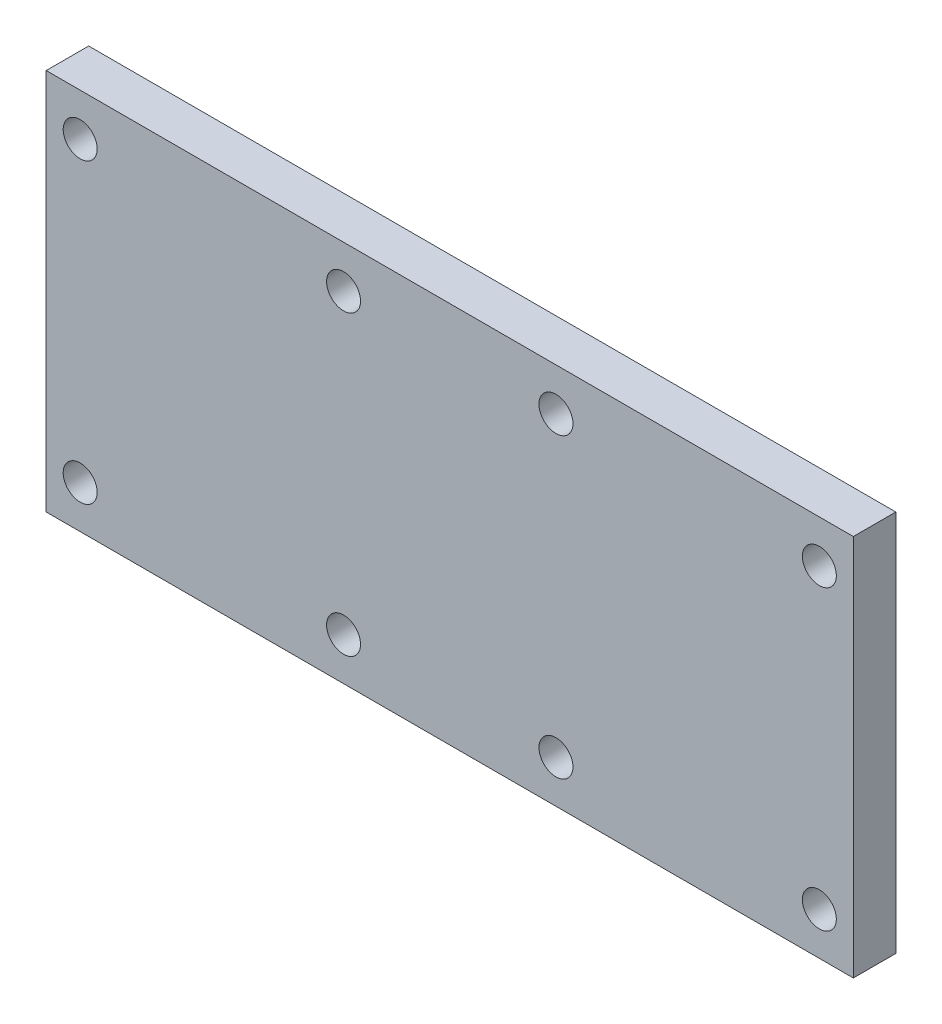
ISO-10303-21;
HEADER;
FILE_DESCRIPTION(('STEP AP214'),'2;1');
FILE_NAME('part.step','',(''),(''),'','','');
FILE_SCHEMA(('AUTOMOTIVE_DESIGN { 1 0 10303 214 1 1 1 1 }'));
ENDSEC;
DATA;
#1=APPLICATION_CONTEXT('core data for automotive mechanical design processes');
#2=APPLICATION_PROTOCOL_DEFINITION('international standard','automotive_design',2000,#1);
#3=PRODUCT_CONTEXT('',#1,'mechanical');
#4=PRODUCT('Part','Part','',(#3));
#5=PRODUCT_RELATED_PRODUCT_CATEGORY('part','',(#4));
#6=PRODUCT_DEFINITION_FORMATION('','',#4);
#7=PRODUCT_DEFINITION_CONTEXT('part definition',#1,'design');
#8=PRODUCT_DEFINITION('design','',#6,#7);
#9=PRODUCT_DEFINITION_SHAPE('','',#8);
#10=(LENGTH_UNIT() NAMED_UNIT(*) SI_UNIT(.MILLI.,.METRE.));
#11=(NAMED_UNIT(*) PLANE_ANGLE_UNIT() SI_UNIT($,.RADIAN.));
#12=(NAMED_UNIT(*) SI_UNIT($,.STERADIAN.) SOLID_ANGLE_UNIT());
#13=UNCERTAINTY_MEASURE_WITH_UNIT(LENGTH_MEASURE(1.E-05),#10,'distance_accuracy_value','');
#14=(GEOMETRIC_REPRESENTATION_CONTEXT(3) GLOBAL_UNCERTAINTY_ASSIGNED_CONTEXT((#13)) GLOBAL_UNIT_ASSIGNED_CONTEXT((#10,
#11,#12)) REPRESENTATION_CONTEXT('',''));
#15=CARTESIAN_POINT('',(0.,0.,0.));
#16=DIRECTION('',(0.,0.,1.));
#17=DIRECTION('',(1.,0.,0.));
#18=AXIS2_PLACEMENT_3D('',#15,#16,#17);
#19=CARTESIAN_POINT('',(47.5,22.5,5.));
#20=DIRECTION('',(-1.,0.,0.));
#21=DIRECTION('',(0.,-1.,0.));
#22=AXIS2_PLACEMENT_3D('',#19,#20,#21);
#23=PLANE('',#22);
#24=DIRECTION('',(0.,1.,0.));
#25=VECTOR('',#24,1.);
#26=CARTESIAN_POINT('',(47.5,22.5,0.));
#27=LINE('',#26,#25);
#28=CARTESIAN_POINT('',(47.5,-22.5,0.));
#29=VERTEX_POINT('',#28);
#30=CARTESIAN_POINT('',(47.5,22.5,0.));
#31=VERTEX_POINT('',#30);
#32=EDGE_CURVE('E96',#29,#31,#27,.T.);
#33=ORIENTED_EDGE('',*,*,#32,.T.);
#34=DIRECTION('',(0.,0.,-1.));
#35=VECTOR('',#34,1.);
#36=CARTESIAN_POINT('',(47.5,22.5,5.));
#37=LINE('',#36,#35);
#38=CARTESIAN_POINT('',(47.5,22.5,5.));
#39=VERTEX_POINT('',#38);
#40=EDGE_CURVE('E11',#39,#31,#37,.T.);
#41=ORIENTED_EDGE('',*,*,#40,.F.);
#42=DIRECTION('',(0.,1.,0.));
#43=VECTOR('',#42,1.);
#44=CARTESIAN_POINT('',(47.5,22.5,5.));
#45=LINE('',#44,#43);
#46=CARTESIAN_POINT('',(47.5,-22.5,5.));
#47=VERTEX_POINT('',#46);
#48=EDGE_CURVE('E84',#47,#39,#45,.T.);
#49=ORIENTED_EDGE('',*,*,#48,.F.);
#50=DIRECTION('',(0.,0.,-1.));
#51=VECTOR('',#50,1.);
#52=CARTESIAN_POINT('',(47.5,-22.5,5.));
#53=LINE('',#52,#51);
#54=EDGE_CURVE('E92',#47,#29,#53,.T.);
#55=ORIENTED_EDGE('',*,*,#54,.T.);
#56=EDGE_LOOP('',(#33,#41,#49,#55));
#57=FACE_BOUND('',#56,.T.);
#58=ADVANCED_FACE('F33',(#57),#23,.F.);
#59=CARTESIAN_POINT('',(-47.5,22.5,5.));
#60=DIRECTION('',(0.,-1.,0.));
#61=DIRECTION('',(0.,0.,-1.));
#62=AXIS2_PLACEMENT_3D('',#59,#60,#61);
#63=PLANE('',#62);
#64=DIRECTION('',(-1.,0.,0.));
#65=VECTOR('',#64,1.);
#66=CARTESIAN_POINT('',(-47.5,22.5,0.));
#67=LINE('',#66,#65);
#68=CARTESIAN_POINT('',(-47.5,22.5,0.));
#69=VERTEX_POINT('',#68);
#70=EDGE_CURVE('E88',#31,#69,#67,.T.);
#71=ORIENTED_EDGE('',*,*,#70,.T.);
#72=DIRECTION('',(0.,0.,-1.));
#73=VECTOR('',#72,1.);
#74=CARTESIAN_POINT('',(-47.5,22.5,5.));
#75=LINE('',#74,#73);
#76=CARTESIAN_POINT('',(-47.5,22.5,5.));
#77=VERTEX_POINT('',#76);
#78=EDGE_CURVE('E41',#77,#69,#75,.T.);
#79=ORIENTED_EDGE('',*,*,#78,.F.);
#80=DIRECTION('',(-1.,0.,0.));
#81=VECTOR('',#80,1.);
#82=CARTESIAN_POINT('',(-47.5,22.5,5.));
#83=LINE('',#82,#81);
#84=EDGE_CURVE('E79',#39,#77,#83,.T.);
#85=ORIENTED_EDGE('',*,*,#84,.F.);
#86=ORIENTED_EDGE('',*,*,#40,.T.);
#87=EDGE_LOOP('',(#71,#79,#85,#86));
#88=FACE_BOUND('',#87,.T.);
#89=ADVANCED_FACE('F87',(#88),#63,.F.);
#90=CARTESIAN_POINT('',(-47.5,22.5,5.));
#91=DIRECTION('',(1.,0.,0.));
#92=DIRECTION('',(0.,1.,0.));
#93=AXIS2_PLACEMENT_3D('',#90,#91,#92);
#94=PLANE('',#93);
#95=DIRECTION('',(0.,-1.,0.));
#96=VECTOR('',#95,1.);
#97=CARTESIAN_POINT('',(-47.5,22.5,0.));
#98=LINE('',#97,#96);
#99=CARTESIAN_POINT('',(-47.5,-22.5,0.));
#100=VERTEX_POINT('',#99);
#101=EDGE_CURVE('E66',#69,#100,#98,.T.);
#102=ORIENTED_EDGE('',*,*,#101,.T.);
#103=DIRECTION('',(0.,0.,-1.));
#104=VECTOR('',#103,1.);
#105=CARTESIAN_POINT('',(-47.5,-22.5,5.));
#106=LINE('',#105,#104);
#107=CARTESIAN_POINT('',(-47.5,-22.5,5.));
#108=VERTEX_POINT('',#107);
#109=EDGE_CURVE('E89',#108,#100,#106,.T.);
#110=ORIENTED_EDGE('',*,*,#109,.F.);
#111=DIRECTION('',(0.,-1.,0.));
#112=VECTOR('',#111,1.);
#113=CARTESIAN_POINT('',(-47.5,22.5,5.));
#114=LINE('',#113,#112);
#115=EDGE_CURVE('E82',#77,#108,#114,.T.);
#116=ORIENTED_EDGE('',*,*,#115,.F.);
#117=ORIENTED_EDGE('',*,*,#78,.T.);
#118=EDGE_LOOP('',(#102,#110,#116,#117));
#119=FACE_BOUND('',#118,.T.);
#120=ADVANCED_FACE('F90',(#119),#94,.F.);
#121=CARTESIAN_POINT('',(-47.5,-22.5,5.));
#122=DIRECTION('',(0.,1.,0.));
#123=DIRECTION('',(0.,0.,1.));
#124=AXIS2_PLACEMENT_3D('',#121,#122,#123);
#125=PLANE('',#124);
#126=DIRECTION('',(1.,0.,0.));
#127=VECTOR('',#126,1.);
#128=CARTESIAN_POINT('',(-47.5,-22.5,0.));
#129=LINE('',#128,#127);
#130=EDGE_CURVE('E72',#100,#29,#129,.T.);
#131=ORIENTED_EDGE('',*,*,#130,.T.);
#132=ORIENTED_EDGE('',*,*,#54,.F.);
#133=DIRECTION('',(1.,0.,0.));
#134=VECTOR('',#133,1.);
#135=CARTESIAN_POINT('',(-47.5,-22.5,5.));
#136=LINE('',#135,#134);
#137=EDGE_CURVE('E49',#108,#47,#136,.T.);
#138=ORIENTED_EDGE('',*,*,#137,.F.);
#139=ORIENTED_EDGE('',*,*,#109,.T.);
#140=EDGE_LOOP('',(#131,#132,#138,#139));
#141=FACE_BOUND('',#140,.T.);
#142=ADVANCED_FACE('F104',(#141),#125,.F.);
#143=CARTESIAN_POINT('',(0.,0.,5.));
#144=DIRECTION('',(0.,0.,1.));
#145=DIRECTION('',(1.,0.,0.));
#146=AXIS2_PLACEMENT_3D('',#143,#144,#145);
#147=PLANE('',#146);
#148=CARTESIAN_POINT('',(43.5,-17.5,5.));
#149=DIRECTION('',(0.,0.,1.));
#150=DIRECTION('',(1.,0.,0.));
#151=AXIS2_PLACEMENT_3D('',#148,#149,#150);
#152=CIRCLE('',#151,2.00000000000001);
#153=CARTESIAN_POINT('',(45.5,-17.5,5.));
#154=VERTEX_POINT('',#153);
#155=EDGE_CURVE('E135',#154,#154,#152,.T.);
#156=ORIENTED_EDGE('',*,*,#155,.F.);
#157=EDGE_LOOP('',(#156));
#158=FACE_BOUND('',#157,.T.);
#159=CARTESIAN_POINT('',(12.5,-17.5,5.));
#160=DIRECTION('',(0.,0.,1.));
#161=DIRECTION('',(1.,0.,0.));
#162=AXIS2_PLACEMENT_3D('',#159,#160,#161);
#163=CIRCLE('',#162,2.);
#164=CARTESIAN_POINT('',(14.5,-17.5,5.));
#165=VERTEX_POINT('',#164);
#166=EDGE_CURVE('E129',#165,#165,#163,.T.);
#167=ORIENTED_EDGE('',*,*,#166,.F.);
#168=EDGE_LOOP('',(#167));
#169=FACE_BOUND('',#168,.T.);
#170=CARTESIAN_POINT('',(12.5,17.5,5.));
#171=DIRECTION('',(0.,0.,1.));
#172=DIRECTION('',(1.,0.,0.));
#173=AXIS2_PLACEMENT_3D('',#170,#171,#172);
#174=CIRCLE('',#173,2.00000000000001);
#175=CARTESIAN_POINT('',(14.5,17.5,5.));
#176=VERTEX_POINT('',#175);
#177=EDGE_CURVE('E123',#176,#176,#174,.T.);
#178=ORIENTED_EDGE('',*,*,#177,.F.);
#179=EDGE_LOOP('',(#178));
#180=FACE_BOUND('',#179,.T.);
#181=CARTESIAN_POINT('',(-12.5,17.5,5.));
#182=DIRECTION('',(0.,0.,1.));
#183=DIRECTION('',(1.,0.,0.));
#184=AXIS2_PLACEMENT_3D('',#181,#182,#183);
#185=CIRCLE('',#184,2.);
#186=CARTESIAN_POINT('',(-10.5,17.5,5.));
#187=VERTEX_POINT('',#186);
#188=EDGE_CURVE('E116',#187,#187,#185,.T.);
#189=ORIENTED_EDGE('',*,*,#188,.F.);
#190=EDGE_LOOP('',(#189));
#191=FACE_BOUND('',#190,.T.);
#192=CARTESIAN_POINT('',(-12.5,-17.5,5.));
#193=DIRECTION('',(0.,0.,1.));
#194=DIRECTION('',(1.,0.,0.));
#195=AXIS2_PLACEMENT_3D('',#192,#193,#194);
#196=CIRCLE('',#195,2.);
#197=CARTESIAN_POINT('',(-10.5,-17.5,5.));
#198=VERTEX_POINT('',#197);
#199=EDGE_CURVE('E152',#198,#198,#196,.T.);
#200=ORIENTED_EDGE('',*,*,#199,.F.);
#201=EDGE_LOOP('',(#200));
#202=FACE_BOUND('',#201,.T.);
#203=CARTESIAN_POINT('',(-43.5,-17.5,5.));
#204=DIRECTION('',(0.,0.,1.));
#205=DIRECTION('',(1.,0.,0.));
#206=AXIS2_PLACEMENT_3D('',#203,#204,#205);
#207=CIRCLE('',#206,2.);
#208=CARTESIAN_POINT('',(-41.5,-17.5,5.));
#209=VERTEX_POINT('',#208);
#210=EDGE_CURVE('E146',#209,#209,#207,.T.);
#211=ORIENTED_EDGE('',*,*,#210,.F.);
#212=EDGE_LOOP('',(#211));
#213=FACE_BOUND('',#212,.T.);
#214=CARTESIAN_POINT('',(-43.5,17.5,5.));
#215=DIRECTION('',(0.,0.,1.));
#216=DIRECTION('',(1.,0.,0.));
#217=AXIS2_PLACEMENT_3D('',#214,#215,#216);
#218=CIRCLE('',#217,2.);
#219=CARTESIAN_POINT('',(-41.5,17.5,5.));
#220=VERTEX_POINT('',#219);
#221=EDGE_CURVE('E140',#220,#220,#218,.T.);
#222=ORIENTED_EDGE('',*,*,#221,.F.);
#223=EDGE_LOOP('',(#222));
#224=FACE_BOUND('',#223,.T.);
#225=CARTESIAN_POINT('',(43.5,17.5,5.));
#226=DIRECTION('',(0.,0.,1.));
#227=DIRECTION('',(1.,0.,0.));
#228=AXIS2_PLACEMENT_3D('',#225,#226,#227);
#229=CIRCLE('',#228,2.);
#230=CARTESIAN_POINT('',(45.5,17.5,5.));
#231=VERTEX_POINT('',#230);
#232=EDGE_CURVE('E110',#231,#231,#229,.T.);
#233=ORIENTED_EDGE('',*,*,#232,.F.);
#234=EDGE_LOOP('',(#233));
#235=FACE_BOUND('',#234,.T.);
#236=ORIENTED_EDGE('',*,*,#48,.T.);
#237=ORIENTED_EDGE('',*,*,#84,.T.);
#238=ORIENTED_EDGE('',*,*,#115,.T.);
#239=ORIENTED_EDGE('',*,*,#137,.T.);
#240=EDGE_LOOP('',(#236,#237,#238,#239));
#241=FACE_BOUND('',#240,.T.);
#242=ADVANCED_FACE('F80',(#158,#169,#180,#191,#202,#213,#224,#235,#241),#147,.T.);
#243=CARTESIAN_POINT('',(0.,0.,0.));
#244=DIRECTION('',(0.,0.,1.));
#245=DIRECTION('',(1.,0.,0.));
#246=AXIS2_PLACEMENT_3D('',#243,#244,#245);
#247=PLANE('',#246);
#248=CARTESIAN_POINT('',(43.5,-17.5,0.));
#249=DIRECTION('',(0.,0.,1.));
#250=DIRECTION('',(1.,0.,0.));
#251=AXIS2_PLACEMENT_3D('',#248,#249,#250);
#252=CIRCLE('',#251,2.00000000000001);
#253=CARTESIAN_POINT('',(45.5,-17.5,0.));
#254=VERTEX_POINT('',#253);
#255=EDGE_CURVE('E113',#254,#254,#252,.T.);
#256=ORIENTED_EDGE('',*,*,#255,.T.);
#257=EDGE_LOOP('',(#256));
#258=FACE_BOUND('',#257,.T.);
#259=CARTESIAN_POINT('',(12.5,-17.5,0.));
#260=DIRECTION('',(0.,0.,1.));
#261=DIRECTION('',(1.,0.,0.));
#262=AXIS2_PLACEMENT_3D('',#259,#260,#261);
#263=CIRCLE('',#262,2.);
#264=CARTESIAN_POINT('',(14.5,-17.5,0.));
#265=VERTEX_POINT('',#264);
#266=EDGE_CURVE('E132',#265,#265,#263,.T.);
#267=ORIENTED_EDGE('',*,*,#266,.T.);
#268=EDGE_LOOP('',(#267));
#269=FACE_BOUND('',#268,.T.);
#270=CARTESIAN_POINT('',(12.5,17.5,0.));
#271=DIRECTION('',(0.,0.,1.));
#272=DIRECTION('',(1.,0.,0.));
#273=AXIS2_PLACEMENT_3D('',#270,#271,#272);
#274=CIRCLE('',#273,2.00000000000001);
#275=CARTESIAN_POINT('',(14.5,17.5,0.));
#276=VERTEX_POINT('',#275);
#277=EDGE_CURVE('E126',#276,#276,#274,.T.);
#278=ORIENTED_EDGE('',*,*,#277,.T.);
#279=EDGE_LOOP('',(#278));
#280=FACE_BOUND('',#279,.T.);
#281=CARTESIAN_POINT('',(-12.5,17.5,0.));
#282=DIRECTION('',(0.,0.,1.));
#283=DIRECTION('',(1.,0.,0.));
#284=AXIS2_PLACEMENT_3D('',#281,#282,#283);
#285=CIRCLE('',#284,2.);
#286=CARTESIAN_POINT('',(-10.5,17.5,0.));
#287=VERTEX_POINT('',#286);
#288=EDGE_CURVE('E119',#287,#287,#285,.T.);
#289=ORIENTED_EDGE('',*,*,#288,.T.);
#290=EDGE_LOOP('',(#289));
#291=FACE_BOUND('',#290,.T.);
#292=CARTESIAN_POINT('',(-12.5,-17.5,0.));
#293=DIRECTION('',(0.,0.,1.));
#294=DIRECTION('',(1.,0.,0.));
#295=AXIS2_PLACEMENT_3D('',#292,#293,#294);
#296=CIRCLE('',#295,2.);
#297=CARTESIAN_POINT('',(-10.5,-17.5,0.));
#298=VERTEX_POINT('',#297);
#299=EDGE_CURVE('E120',#298,#298,#296,.T.);
#300=ORIENTED_EDGE('',*,*,#299,.T.);
#301=EDGE_LOOP('',(#300));
#302=FACE_BOUND('',#301,.T.);
#303=CARTESIAN_POINT('',(-43.5,-17.5,0.));
#304=DIRECTION('',(0.,0.,1.));
#305=DIRECTION('',(1.,0.,0.));
#306=AXIS2_PLACEMENT_3D('',#303,#304,#305);
#307=CIRCLE('',#306,2.);
#308=CARTESIAN_POINT('',(-41.5,-17.5,0.));
#309=VERTEX_POINT('',#308);
#310=EDGE_CURVE('E149',#309,#309,#307,.T.);
#311=ORIENTED_EDGE('',*,*,#310,.T.);
#312=EDGE_LOOP('',(#311));
#313=FACE_BOUND('',#312,.T.);
#314=CARTESIAN_POINT('',(-43.5,17.5,0.));
#315=DIRECTION('',(0.,0.,1.));
#316=DIRECTION('',(1.,0.,0.));
#317=AXIS2_PLACEMENT_3D('',#314,#315,#316);
#318=CIRCLE('',#317,2.);
#319=CARTESIAN_POINT('',(-41.5,17.5,0.));
#320=VERTEX_POINT('',#319);
#321=EDGE_CURVE('E143',#320,#320,#318,.T.);
#322=ORIENTED_EDGE('',*,*,#321,.T.);
#323=EDGE_LOOP('',(#322));
#324=FACE_BOUND('',#323,.T.);
#325=CARTESIAN_POINT('',(43.5,17.5,0.));
#326=DIRECTION('',(0.,0.,1.));
#327=DIRECTION('',(1.,0.,0.));
#328=AXIS2_PLACEMENT_3D('',#325,#326,#327);
#329=CIRCLE('',#328,2.);
#330=CARTESIAN_POINT('',(45.5,17.5,0.));
#331=VERTEX_POINT('',#330);
#332=EDGE_CURVE('E99',#331,#331,#329,.T.);
#333=ORIENTED_EDGE('',*,*,#332,.T.);
#334=EDGE_LOOP('',(#333));
#335=FACE_BOUND('',#334,.T.);
#336=ORIENTED_EDGE('',*,*,#32,.F.);
#337=ORIENTED_EDGE('',*,*,#130,.F.);
#338=ORIENTED_EDGE('',*,*,#101,.F.);
#339=ORIENTED_EDGE('',*,*,#70,.F.);
#340=EDGE_LOOP('',(#336,#337,#338,#339));
#341=FACE_BOUND('',#340,.T.);
#342=ADVANCED_FACE('F107',(#258,#269,#280,#291,#302,#313,#324,#335,#341),#247,.F.);
#343=CARTESIAN_POINT('',(43.5,17.5,0.));
#344=DIRECTION('',(0.,0.,1.));
#345=DIRECTION('',(1.,0.,0.));
#346=AXIS2_PLACEMENT_3D('',#343,#344,#345);
#347=CYLINDRICAL_SURFACE('',#346,2.);
#348=ORIENTED_EDGE('',*,*,#332,.F.);
#349=EDGE_LOOP('',(#348));
#350=FACE_BOUND('',#349,.T.);
#351=ORIENTED_EDGE('',*,*,#232,.T.);
#352=EDGE_LOOP('',(#351));
#353=FACE_BOUND('',#352,.T.);
#354=ADVANCED_FACE('F178',(#350,#353),#347,.F.);
#355=CARTESIAN_POINT('',(-43.5,17.5,0.));
#356=DIRECTION('',(0.,0.,1.));
#357=DIRECTION('',(1.,0.,0.));
#358=AXIS2_PLACEMENT_3D('',#355,#356,#357);
#359=CYLINDRICAL_SURFACE('',#358,2.);
#360=ORIENTED_EDGE('',*,*,#321,.F.);
#361=EDGE_LOOP('',(#360));
#362=FACE_BOUND('',#361,.T.);
#363=ORIENTED_EDGE('',*,*,#221,.T.);
#364=EDGE_LOOP('',(#363));
#365=FACE_BOUND('',#364,.T.);
#366=ADVANCED_FACE('F180',(#362,#365),#359,.F.);
#367=CARTESIAN_POINT('',(-43.5,-17.5,0.));
#368=DIRECTION('',(0.,0.,1.));
#369=DIRECTION('',(1.,0.,0.));
#370=AXIS2_PLACEMENT_3D('',#367,#368,#369);
#371=CYLINDRICAL_SURFACE('',#370,2.);
#372=ORIENTED_EDGE('',*,*,#310,.F.);
#373=EDGE_LOOP('',(#372));
#374=FACE_BOUND('',#373,.T.);
#375=ORIENTED_EDGE('',*,*,#210,.T.);
#376=EDGE_LOOP('',(#375));
#377=FACE_BOUND('',#376,.T.);
#378=ADVANCED_FACE('F164',(#374,#377),#371,.F.);
#379=CARTESIAN_POINT('',(-12.5,-17.5,0.));
#380=DIRECTION('',(0.,0.,1.));
#381=DIRECTION('',(1.,0.,0.));
#382=AXIS2_PLACEMENT_3D('',#379,#380,#381);
#383=CYLINDRICAL_SURFACE('',#382,2.);
#384=ORIENTED_EDGE('',*,*,#299,.F.);
#385=EDGE_LOOP('',(#384));
#386=FACE_BOUND('',#385,.T.);
#387=ORIENTED_EDGE('',*,*,#199,.T.);
#388=EDGE_LOOP('',(#387));
#389=FACE_BOUND('',#388,.T.);
#390=ADVANCED_FACE('F160',(#386,#389),#383,.F.);
#391=CARTESIAN_POINT('',(-12.5,17.5,0.));
#392=DIRECTION('',(0.,0.,1.));
#393=DIRECTION('',(1.,0.,0.));
#394=AXIS2_PLACEMENT_3D('',#391,#392,#393);
#395=CYLINDRICAL_SURFACE('',#394,2.);
#396=ORIENTED_EDGE('',*,*,#288,.F.);
#397=EDGE_LOOP('',(#396));
#398=FACE_BOUND('',#397,.T.);
#399=ORIENTED_EDGE('',*,*,#188,.T.);
#400=EDGE_LOOP('',(#399));
#401=FACE_BOUND('',#400,.T.);
#402=ADVANCED_FACE('F163',(#398,#401),#395,.F.);
#403=CARTESIAN_POINT('',(12.5,17.5,0.));
#404=DIRECTION('',(0.,0.,1.));
#405=DIRECTION('',(1.,0.,0.));
#406=AXIS2_PLACEMENT_3D('',#403,#404,#405);
#407=CYLINDRICAL_SURFACE('',#406,2.00000000000001);
#408=ORIENTED_EDGE('',*,*,#277,.F.);
#409=EDGE_LOOP('',(#408));
#410=FACE_BOUND('',#409,.T.);
#411=ORIENTED_EDGE('',*,*,#177,.T.);
#412=EDGE_LOOP('',(#411));
#413=FACE_BOUND('',#412,.T.);
#414=ADVANCED_FACE('F251',(#410,#413),#407,.F.);
#415=CARTESIAN_POINT('',(12.5,-17.5,0.));
#416=DIRECTION('',(0.,0.,1.));
#417=DIRECTION('',(1.,0.,0.));
#418=AXIS2_PLACEMENT_3D('',#415,#416,#417);
#419=CYLINDRICAL_SURFACE('',#418,2.);
#420=ORIENTED_EDGE('',*,*,#266,.F.);
#421=EDGE_LOOP('',(#420));
#422=FACE_BOUND('',#421,.T.);
#423=ORIENTED_EDGE('',*,*,#166,.T.);
#424=EDGE_LOOP('',(#423));
#425=FACE_BOUND('',#424,.T.);
#426=ADVANCED_FACE('F260',(#422,#425),#419,.F.);
#427=CARTESIAN_POINT('',(43.5,-17.5,0.));
#428=DIRECTION('',(0.,0.,1.));
#429=DIRECTION('',(1.,0.,0.));
#430=AXIS2_PLACEMENT_3D('',#427,#428,#429);
#431=CYLINDRICAL_SURFACE('',#430,2.00000000000001);
#432=ORIENTED_EDGE('',*,*,#255,.F.);
#433=EDGE_LOOP('',(#432));
#434=FACE_BOUND('',#433,.T.);
#435=ORIENTED_EDGE('',*,*,#155,.T.);
#436=EDGE_LOOP('',(#435));
#437=FACE_BOUND('',#436,.T.);
#438=ADVANCED_FACE('F270',(#434,#437),#431,.F.);
#439=CLOSED_SHELL('',(#58,#89,#120,#142,#242,#342,#354,#366,#378,#390,#402,#414,#426,#438));
#440=MANIFOLD_SOLID_BREP('B2',#439);
#441=ADVANCED_BREP_SHAPE_REPRESENTATION('',(#18,#440),#14);
#442=SHAPE_DEFINITION_REPRESENTATION(#9,#441);
ENDSEC;
END-ISO-10303-21;
